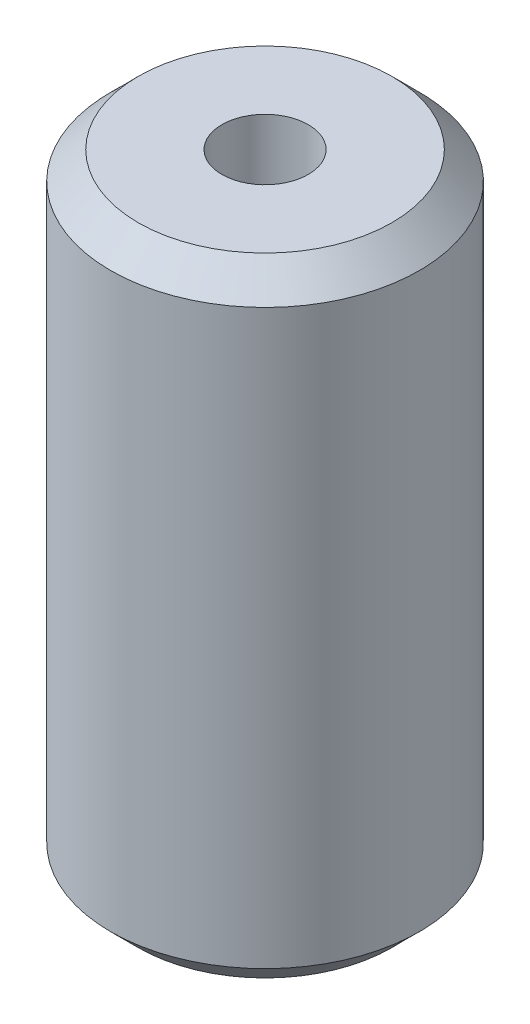
ISO-10303-21;
HEADER;
FILE_DESCRIPTION(('STEP AP214'),'2;1');
FILE_NAME('part.step','',(''),(''),'','','');
FILE_SCHEMA(('AUTOMOTIVE_DESIGN { 1 0 10303 214 1 1 1 1 }'));
ENDSEC;
DATA;
#1=APPLICATION_CONTEXT('core data for automotive mechanical design processes');
#2=APPLICATION_PROTOCOL_DEFINITION('international standard','automotive_design',2000,#1);
#3=PRODUCT_CONTEXT('',#1,'mechanical');
#4=PRODUCT('Part','Part','',(#3));
#5=PRODUCT_RELATED_PRODUCT_CATEGORY('part','',(#4));
#6=PRODUCT_DEFINITION_FORMATION('','',#4);
#7=PRODUCT_DEFINITION_CONTEXT('part definition',#1,'design');
#8=PRODUCT_DEFINITION('design','',#6,#7);
#9=PRODUCT_DEFINITION_SHAPE('','',#8);
#10=(LENGTH_UNIT() NAMED_UNIT(*) SI_UNIT(.MILLI.,.METRE.));
#11=(NAMED_UNIT(*) PLANE_ANGLE_UNIT() SI_UNIT($,.RADIAN.));
#12=(NAMED_UNIT(*) SI_UNIT($,.STERADIAN.) SOLID_ANGLE_UNIT());
#13=UNCERTAINTY_MEASURE_WITH_UNIT(LENGTH_MEASURE(1.E-05),#10,'distance_accuracy_value','');
#14=(GEOMETRIC_REPRESENTATION_CONTEXT(3) GLOBAL_UNCERTAINTY_ASSIGNED_CONTEXT((#13)) GLOBAL_UNIT_ASSIGNED_CONTEXT((#10,
#11,#12)) REPRESENTATION_CONTEXT('',''));
#15=CARTESIAN_POINT('',(0.,0.,0.));
#16=DIRECTION('',(0.,0.,1.));
#17=DIRECTION('',(1.,0.,0.));
#18=AXIS2_PLACEMENT_3D('',#15,#16,#17);
#19=CARTESIAN_POINT('',(0.,81.3196268717931,0.));
#20=DIRECTION('',(0.,-1.,0.));
#21=DIRECTION('',(0.,0.,-1.));
#22=AXIS2_PLACEMENT_3D('',#19,#20,#21);
#23=CYLINDRICAL_SURFACE('',#22,20.);
#24=CARTESIAN_POINT('',(0.,77.7450519635917,0.));
#25=DIRECTION('',(0.,1.,0.));
#26=DIRECTION('',(0.,0.,1.));
#27=AXIS2_PLACEMENT_3D('',#24,#25,#26);
#28=CIRCLE('',#27,20.);
#29=CARTESIAN_POINT('',(0.,77.7450519635917,20.));
#30=VERTEX_POINT('',#29);
#31=EDGE_CURVE('E50',#30,#30,#28,.F.);
#32=ORIENTED_EDGE('',*,*,#31,.T.);
#33=EDGE_LOOP('',(#32));
#34=FACE_BOUND('',#33,.T.);
#35=CARTESIAN_POINT('',(0.,3.57457490820129,0.));
#36=DIRECTION('',(0.,1.,0.));
#37=DIRECTION('',(0.,0.,1.));
#38=AXIS2_PLACEMENT_3D('',#35,#36,#37);
#39=CIRCLE('',#38,20.);
#40=CARTESIAN_POINT('',(0.,3.57457490820129,20.));
#41=VERTEX_POINT('',#40);
#42=EDGE_CURVE('E51',#41,#41,#39,.T.);
#43=ORIENTED_EDGE('',*,*,#42,.T.);
#44=EDGE_LOOP('',(#43));
#45=FACE_BOUND('',#44,.T.);
#46=ADVANCED_FACE('F39',(#34,#45),#23,.T.);
#47=CARTESIAN_POINT('',(0.,81.3196268717931,0.));
#48=DIRECTION('',(0.,1.,0.));
#49=DIRECTION('',(0.,0.,1.));
#50=AXIS2_PLACEMENT_3D('',#47,#48,#49);
#51=PLANE('',#50);
#52=CARTESIAN_POINT('',(0.,81.3196268717931,0.));
#53=DIRECTION('',(0.,1.,0.));
#54=DIRECTION('',(0.,0.,1.));
#55=AXIS2_PLACEMENT_3D('',#52,#53,#54);
#56=CIRCLE('',#55,16.4254250917987);
#57=CARTESIAN_POINT('',(0.,81.3196268717931,16.4254250917987));
#58=VERTEX_POINT('',#57);
#59=EDGE_CURVE('E54',#58,#58,#56,.T.);
#60=ORIENTED_EDGE('',*,*,#59,.T.);
#61=EDGE_LOOP('',(#60));
#62=FACE_BOUND('',#61,.T.);
#63=CARTESIAN_POINT('',(0.,81.3196268717931,0.));
#64=DIRECTION('',(0.,1.,0.));
#65=DIRECTION('',(0.,0.,1.));
#66=AXIS2_PLACEMENT_3D('',#63,#64,#65);
#67=CIRCLE('',#66,5.59349415681422);
#68=CARTESIAN_POINT('',(0.,81.3196268717931,5.59349415681422));
#69=VERTEX_POINT('',#68);
#70=EDGE_CURVE('E58',#69,#69,#67,.T.);
#71=ORIENTED_EDGE('',*,*,#70,.F.);
#72=EDGE_LOOP('',(#71));
#73=FACE_BOUND('',#72,.T.);
#74=ADVANCED_FACE('F69',(#62,#73),#51,.T.);
#75=CARTESIAN_POINT('',(0.,0.,0.));
#76=DIRECTION('',(0.,1.,0.));
#77=DIRECTION('',(0.,0.,1.));
#78=AXIS2_PLACEMENT_3D('',#75,#76,#77);
#79=PLANE('',#78);
#80=CARTESIAN_POINT('',(0.,0.,0.));
#81=DIRECTION('',(0.,1.,0.));
#82=DIRECTION('',(0.,0.,1.));
#83=AXIS2_PLACEMENT_3D('',#80,#81,#82);
#84=CIRCLE('',#83,16.4254250917987);
#85=CARTESIAN_POINT('',(0.,0.,16.4254250917987));
#86=VERTEX_POINT('',#85);
#87=EDGE_CURVE('E10',#86,#86,#84,.F.);
#88=ORIENTED_EDGE('',*,*,#87,.T.);
#89=EDGE_LOOP('',(#88));
#90=FACE_BOUND('',#89,.T.);
#91=CARTESIAN_POINT('',(0.,0.,0.));
#92=DIRECTION('',(0.,1.,0.));
#93=DIRECTION('',(0.,0.,1.));
#94=AXIS2_PLACEMENT_3D('',#91,#92,#93);
#95=CIRCLE('',#94,5.59349415681422);
#96=CARTESIAN_POINT('',(0.,0.,5.59349415681422));
#97=VERTEX_POINT('',#96);
#98=EDGE_CURVE('E63',#97,#97,#95,.T.);
#99=ORIENTED_EDGE('',*,*,#98,.T.);
#100=EDGE_LOOP('',(#99));
#101=FACE_BOUND('',#100,.T.);
#102=ADVANCED_FACE('F75',(#90,#101),#79,.F.);
#103=CARTESIAN_POINT('',(0.,81.3196268717931,0.));
#104=DIRECTION('',(0.,-1.,0.));
#105=DIRECTION('',(0.,0.,-1.));
#106=AXIS2_PLACEMENT_3D('',#103,#104,#105);
#107=CYLINDRICAL_SURFACE('',#106,5.59349415681422);
#108=ORIENTED_EDGE('',*,*,#70,.T.);
#109=EDGE_LOOP('',(#108));
#110=FACE_BOUND('',#109,.T.);
#111=ORIENTED_EDGE('',*,*,#98,.F.);
#112=EDGE_LOOP('',(#111));
#113=FACE_BOUND('',#112,.T.);
#114=ADVANCED_FACE('F70',(#110,#113),#107,.F.);
#115=CARTESIAN_POINT('',(0.,81.3196268717931,0.));
#116=DIRECTION('',(0.,-1.,0.));
#117=DIRECTION('',(0.,0.,-1.));
#118=AXIS2_PLACEMENT_3D('',#115,#116,#117);
#119=CONICAL_SURFACE('',#118,16.4254250917987,0.785398163397444);
#120=ORIENTED_EDGE('',*,*,#31,.F.);
#121=EDGE_LOOP('',(#120));
#122=FACE_BOUND('',#121,.T.);
#123=ORIENTED_EDGE('',*,*,#59,.F.);
#124=EDGE_LOOP('',(#123));
#125=FACE_BOUND('',#124,.T.);
#126=ADVANCED_FACE('F81',(#122,#125),#119,.T.);
#127=CARTESIAN_POINT('',(0.,3.57457490820129,0.));
#128=DIRECTION('',(0.,1.,0.));
#129=DIRECTION('',(0.,0.,1.));
#130=AXIS2_PLACEMENT_3D('',#127,#128,#129);
#131=CONICAL_SURFACE('',#130,20.,0.785398163397453);
#132=ORIENTED_EDGE('',*,*,#87,.F.);
#133=EDGE_LOOP('',(#132));
#134=FACE_BOUND('',#133,.T.);
#135=ORIENTED_EDGE('',*,*,#42,.F.);
#136=EDGE_LOOP('',(#135));
#137=FACE_BOUND('',#136,.T.);
#138=ADVANCED_FACE('F45',(#134,#137),#131,.T.);
#139=CLOSED_SHELL('',(#46,#74,#102,#114,#126,#138));
#140=MANIFOLD_SOLID_BREP('B2',#139);
#141=ADVANCED_BREP_SHAPE_REPRESENTATION('',(#18,#140),#14);
#142=SHAPE_DEFINITION_REPRESENTATION(#9,#141);
ENDSEC;
END-ISO-10303-21;
